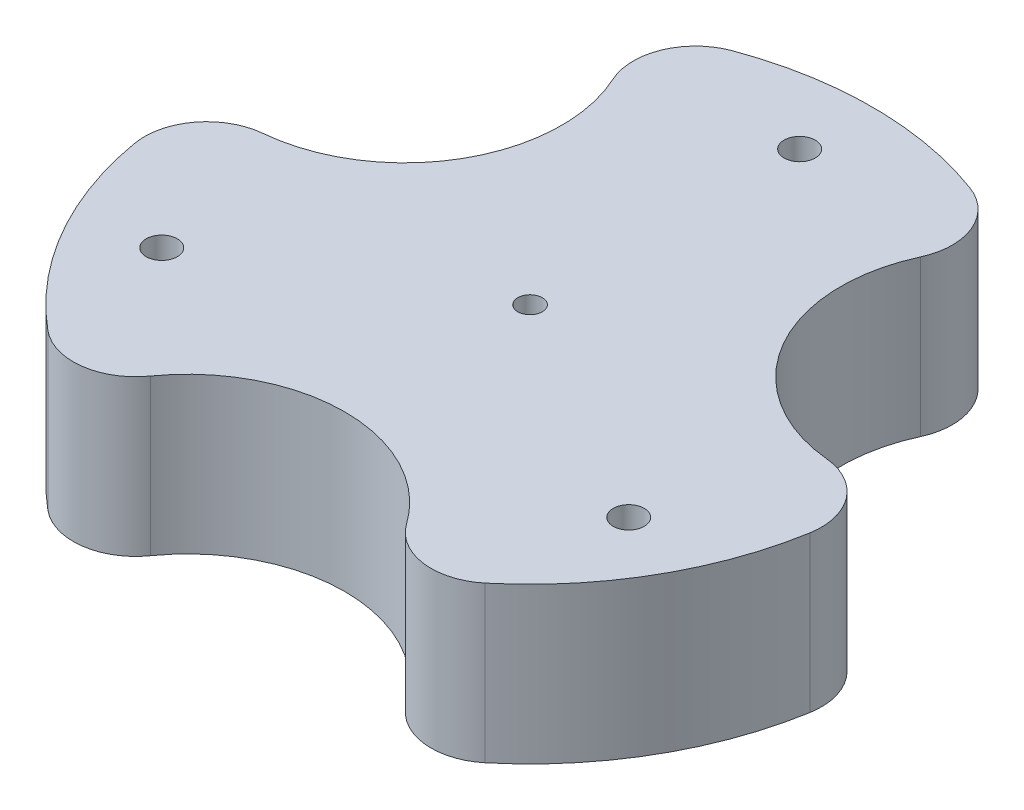
ISO-10303-21;
HEADER;
FILE_DESCRIPTION(('STEP AP214'),'2;1');
FILE_NAME('part.step','',(''),(''),'','','');
FILE_SCHEMA(('AUTOMOTIVE_DESIGN { 1 0 10303 214 1 1 1 1 }'));
ENDSEC;
DATA;
#1=APPLICATION_CONTEXT('core data for automotive mechanical design processes');
#2=APPLICATION_PROTOCOL_DEFINITION('international standard','automotive_design',2000,#1);
#3=PRODUCT_CONTEXT('',#1,'mechanical');
#4=PRODUCT('Part','Part','',(#3));
#5=PRODUCT_RELATED_PRODUCT_CATEGORY('part','',(#4));
#6=PRODUCT_DEFINITION_FORMATION('','',#4);
#7=PRODUCT_DEFINITION_CONTEXT('part definition',#1,'design');
#8=PRODUCT_DEFINITION('design','',#6,#7);
#9=PRODUCT_DEFINITION_SHAPE('','',#8);
#10=(LENGTH_UNIT() NAMED_UNIT(*) SI_UNIT(.MILLI.,.METRE.));
#11=(NAMED_UNIT(*) PLANE_ANGLE_UNIT() SI_UNIT($,.RADIAN.));
#12=(NAMED_UNIT(*) SI_UNIT($,.STERADIAN.) SOLID_ANGLE_UNIT());
#13=UNCERTAINTY_MEASURE_WITH_UNIT(LENGTH_MEASURE(1.E-05),#10,'distance_accuracy_value','');
#14=(GEOMETRIC_REPRESENTATION_CONTEXT(3) GLOBAL_UNCERTAINTY_ASSIGNED_CONTEXT((#13)) GLOBAL_UNIT_ASSIGNED_CONTEXT((#10,
#11,#12)) REPRESENTATION_CONTEXT('',''));
#15=CARTESIAN_POINT('',(0.,0.,0.));
#16=DIRECTION('',(0.,0.,1.));
#17=DIRECTION('',(1.,0.,0.));
#18=AXIS2_PLACEMENT_3D('',#15,#16,#17);
#19=CARTESIAN_POINT('',(0.,6.35,0.));
#20=DIRECTION('',(0.,-1.,0.));
#21=DIRECTION('',(0.,0.,-1.));
#22=AXIS2_PLACEMENT_3D('',#19,#20,#21);
#23=CYLINDRICAL_SURFACE('',#22,13.97);
#24=CARTESIAN_POINT('',(0.,0.,0.));
#25=DIRECTION('',(0.,1.,0.));
#26=DIRECTION('',(0.,0.,1.));
#27=AXIS2_PLACEMENT_3D('',#24,#25,#26);
#28=CIRCLE('',#27,13.97);
#29=CARTESIAN_POINT('',(8.92101024492811,0.,10.7506500366205));
#30=VERTEX_POINT('',#29);
#31=CARTESIAN_POINT('',(13.7708411613735,0.,2.35049648121887));
#32=VERTEX_POINT('',#31);
#33=EDGE_CURVE('E140',#30,#32,#28,.T.);
#34=ORIENTED_EDGE('',*,*,#33,.T.);
#35=DIRECTION('',(0.,-1.,0.));
#36=VECTOR('',#35,1.);
#37=CARTESIAN_POINT('',(13.7708411613735,6.35,2.35049648121887));
#38=LINE('',#37,#36);
#39=CARTESIAN_POINT('',(13.7708411613735,6.35,2.35049648121887));
#40=VERTEX_POINT('',#39);
#41=EDGE_CURVE('E144',#32,#40,#38,.F.);
#42=ORIENTED_EDGE('',*,*,#41,.T.);
#43=CARTESIAN_POINT('',(0.,6.35,0.));
#44=DIRECTION('',(0.,1.,0.));
#45=DIRECTION('',(0.,0.,1.));
#46=AXIS2_PLACEMENT_3D('',#43,#44,#45);
#47=CIRCLE('',#46,13.97);
#48=CARTESIAN_POINT('',(8.92101024492811,6.35,10.7506500366205));
#49=VERTEX_POINT('',#48);
#50=EDGE_CURVE('E143',#49,#40,#47,.T.);
#51=ORIENTED_EDGE('',*,*,#50,.F.);
#52=DIRECTION('',(0.,-1.,0.));
#53=VECTOR('',#52,1.);
#54=CARTESIAN_POINT('',(8.92101024492811,6.35,10.7506500366205));
#55=LINE('',#54,#53);
#56=EDGE_CURVE('E128',#49,#30,#55,.T.);
#57=ORIENTED_EDGE('',*,*,#56,.T.);
#58=EDGE_LOOP('',(#34,#42,#51,#57));
#59=FACE_BOUND('',#58,.T.);
#60=ADVANCED_FACE('F34',(#59),#23,.T.);
#61=CARTESIAN_POINT('',(4.8498309164455,0.,-13.1011465178392));
#62=VERTEX_POINT('',#61);
#63=CARTESIAN_POINT('',(-4.84983091644532,0.,-13.1011465178392));
#64=VERTEX_POINT('',#63);
#65=EDGE_CURVE('E150',#62,#64,#28,.T.);
#66=ORIENTED_EDGE('',*,*,#65,.T.);
#67=DIRECTION('',(0.,-1.,0.));
#68=VECTOR('',#67,1.);
#69=CARTESIAN_POINT('',(-4.84983091644532,6.35,-13.1011465178392));
#70=LINE('',#69,#68);
#71=CARTESIAN_POINT('',(-4.84983091644532,6.35,-13.1011465178392));
#72=VERTEX_POINT('',#71);
#73=EDGE_CURVE('E11',#64,#72,#70,.F.);
#74=ORIENTED_EDGE('',*,*,#73,.T.);
#75=CARTESIAN_POINT('',(4.8498309164455,6.35,-13.1011465178392));
#76=VERTEX_POINT('',#75);
#77=EDGE_CURVE('E154',#76,#72,#47,.T.);
#78=ORIENTED_EDGE('',*,*,#77,.F.);
#79=DIRECTION('',(0.,-1.,0.));
#80=VECTOR('',#79,1.);
#81=CARTESIAN_POINT('',(4.8498309164455,6.35,-13.1011465178392));
#82=LINE('',#81,#80);
#83=EDGE_CURVE('E42',#76,#62,#82,.T.);
#84=ORIENTED_EDGE('',*,*,#83,.T.);
#85=EDGE_LOOP('',(#66,#74,#78,#84));
#86=FACE_BOUND('',#85,.T.);
#87=ADVANCED_FACE('F234',(#86),#23,.T.);
#88=CARTESIAN_POINT('',(-13.7708411613735,0.,2.35049648121868));
#89=VERTEX_POINT('',#88);
#90=CARTESIAN_POINT('',(-8.92101024492811,0.,10.7506500366205));
#91=VERTEX_POINT('',#90);
#92=EDGE_CURVE('E152',#89,#91,#28,.T.);
#93=ORIENTED_EDGE('',*,*,#92,.T.);
#94=DIRECTION('',(0.,-1.,0.));
#95=VECTOR('',#94,1.);
#96=CARTESIAN_POINT('',(-8.92101024492811,6.35,10.7506500366205));
#97=LINE('',#96,#95);
#98=CARTESIAN_POINT('',(-8.92101024492811,6.35,10.7506500366205));
#99=VERTEX_POINT('',#98);
#100=EDGE_CURVE('E386',#91,#99,#97,.F.);
#101=ORIENTED_EDGE('',*,*,#100,.T.);
#102=CARTESIAN_POINT('',(-13.7708411613735,6.35,2.35049648121868));
#103=VERTEX_POINT('',#102);
#104=EDGE_CURVE('E149',#103,#99,#47,.T.);
#105=ORIENTED_EDGE('',*,*,#104,.F.);
#106=DIRECTION('',(0.,-1.,0.));
#107=VECTOR('',#106,1.);
#108=CARTESIAN_POINT('',(-13.7708411613735,6.35,2.35049648121868));
#109=LINE('',#108,#107);
#110=EDGE_CURVE('E395',#103,#89,#109,.T.);
#111=ORIENTED_EDGE('',*,*,#110,.T.);
#112=EDGE_LOOP('',(#93,#101,#105,#111));
#113=FACE_BOUND('',#112,.T.);
#114=ADVANCED_FACE('F210',(#113),#23,.T.);
#115=CARTESIAN_POINT('',(0.,6.35,0.));
#116=DIRECTION('',(0.,1.,0.));
#117=DIRECTION('',(0.,0.,1.));
#118=AXIS2_PLACEMENT_3D('',#115,#116,#117);
#119=PLANE('',#118);
#120=CARTESIAN_POINT('',(0.,6.35,0.));
#121=DIRECTION('',(0.,1.,0.));
#122=DIRECTION('',(0.,0.,1.));
#123=AXIS2_PLACEMENT_3D('',#120,#121,#122);
#124=CIRCLE('',#123,0.499999999999997);
#125=CARTESIAN_POINT('',(0.,6.35,0.499999999999997));
#126=VERTEX_POINT('',#125);
#127=EDGE_CURVE('E200',#126,#126,#124,.T.);
#128=ORIENTED_EDGE('',*,*,#127,.F.);
#129=EDGE_LOOP('',(#128));
#130=FACE_BOUND('',#129,.T.);
#131=ORIENTED_EDGE('',*,*,#50,.T.);
#132=CARTESIAN_POINT('',(11.2670518593056,6.35,1.92313348463362));
#133=DIRECTION('',(0.,1.,0.));
#134=DIRECTION('',(0.,0.,1.));
#135=AXIS2_PLACEMENT_3D('',#132,#133,#134);
#136=CIRCLE('',#135,2.54);
#137=CARTESIAN_POINT('',(11.5030637447277,6.35,-0.605877861710929));
#138=VERTEX_POINT('',#137);
#139=EDGE_CURVE('E416',#40,#138,#136,.T.);
#140=ORIENTED_EDGE('',*,*,#139,.T.);
#141=CARTESIAN_POINT('',(12.0983748908687,6.35,-6.98499999999989));
#142=DIRECTION('',(0.,1.,0.));
#143=DIRECTION('',(0.866025403784443,0.,-0.499999999999992));
#144=AXIS2_PLACEMENT_3D('',#141,#142,#143);
#145=CIRCLE('',#144,6.40683967459214);
#146=CARTESIAN_POINT('',(6.2762374921963,6.35,-9.65900649343038));
#147=VERTEX_POINT('',#146);
#148=EDGE_CURVE('E193',#147,#138,#145,.T.);
#149=ORIENTED_EDGE('',*,*,#148,.F.);
#150=CARTESIAN_POINT('',(3.96804347709178,6.35,-10.719119878232));
#151=DIRECTION('',(0.,1.,0.));
#152=DIRECTION('',(0.,0.,1.));
#153=AXIS2_PLACEMENT_3D('',#150,#151,#152);
#154=CIRCLE('',#153,2.54);
#155=EDGE_CURVE('E426',#147,#76,#154,.T.);
#156=ORIENTED_EDGE('',*,*,#155,.T.);
#157=ORIENTED_EDGE('',*,*,#77,.T.);
#158=CARTESIAN_POINT('',(-3.96804347709163,6.35,-10.7191198782321));
#159=DIRECTION('',(0.,1.,0.));
#160=DIRECTION('',(0.,0.,1.));
#161=AXIS2_PLACEMENT_3D('',#158,#159,#160);
#162=CIRCLE('',#161,2.54);
#163=CARTESIAN_POINT('',(-6.27623749219617,6.35,-9.65900649343047));
#164=VERTEX_POINT('',#163);
#165=EDGE_CURVE('E424',#72,#164,#162,.T.);
#166=ORIENTED_EDGE('',*,*,#165,.T.);
#167=CARTESIAN_POINT('',(-12.0983748908686,6.35,-6.98500000000006));
#168=DIRECTION('',(0.,1.,0.));
#169=DIRECTION('',(-0.866025403784436,0.,-0.500000000000004));
#170=AXIS2_PLACEMENT_3D('',#167,#168,#169);
#171=CIRCLE('',#170,6.40683967459214);
#172=CARTESIAN_POINT('',(-11.5030637447277,6.35,-0.605877861711092));
#173=VERTEX_POINT('',#172);
#174=EDGE_CURVE('E189',#173,#164,#171,.T.);
#175=ORIENTED_EDGE('',*,*,#174,.F.);
#176=CARTESIAN_POINT('',(-11.2670518593056,6.35,1.92313348463346));
#177=DIRECTION('',(0.,1.,0.));
#178=DIRECTION('',(0.,0.,1.));
#179=AXIS2_PLACEMENT_3D('',#176,#177,#178);
#180=CIRCLE('',#179,2.54);
#181=EDGE_CURVE('E422',#173,#103,#180,.T.);
#182=ORIENTED_EDGE('',*,*,#181,.T.);
#183=ORIENTED_EDGE('',*,*,#104,.T.);
#184=CARTESIAN_POINT('',(-7.29900838221391,6.35,8.79598639359857));
#185=DIRECTION('',(0.,1.,0.));
#186=DIRECTION('',(0.,0.,1.));
#187=AXIS2_PLACEMENT_3D('',#184,#185,#186);
#188=CIRCLE('',#187,2.54);
#189=CARTESIAN_POINT('',(-5.22682625253151,6.35,10.2648843551415));
#190=VERTEX_POINT('',#189);
#191=EDGE_CURVE('E420',#99,#190,#188,.T.);
#192=ORIENTED_EDGE('',*,*,#191,.T.);
#193=CARTESIAN_POINT('',(0.,6.35,13.97));
#194=DIRECTION('',(0.,1.,0.));
#195=DIRECTION('',(0.,0.,1.));
#196=AXIS2_PLACEMENT_3D('',#193,#194,#195);
#197=CIRCLE('',#196,6.40683967459214);
#198=CARTESIAN_POINT('',(5.22682625253151,6.35,10.2648843551415));
#199=VERTEX_POINT('',#198);
#200=EDGE_CURVE('E184',#199,#190,#197,.T.);
#201=ORIENTED_EDGE('',*,*,#200,.F.);
#202=CARTESIAN_POINT('',(7.29900838221391,6.35,8.79598639359857));
#203=DIRECTION('',(0.,1.,0.));
#204=DIRECTION('',(0.,0.,1.));
#205=AXIS2_PLACEMENT_3D('',#202,#203,#204);
#206=CIRCLE('',#205,2.54);
#207=EDGE_CURVE('E418',#199,#49,#206,.T.);
#208=ORIENTED_EDGE('',*,*,#207,.T.);
#209=EDGE_LOOP('',(#131,#140,#149,#156,#157,#166,#175,#182,#183,#192,#201,#208));
#210=FACE_BOUND('',#209,.T.);
#211=CARTESIAN_POINT('',(-9.52627944162887,6.35,5.49999999999991));
#212=DIRECTION('',(0.,1.,0.));
#213=DIRECTION('',(0.866025403784443,0.,-0.499999999999992));
#214=AXIS2_PLACEMENT_3D('',#211,#212,#213);
#215=CIRCLE('',#214,0.635);
#216=CARTESIAN_POINT('',(-8.97635331022575,6.35,5.18249999999992));
#217=VERTEX_POINT('',#216);
#218=EDGE_CURVE('E178',#217,#217,#215,.T.);
#219=ORIENTED_EDGE('',*,*,#218,.F.);
#220=EDGE_LOOP('',(#219));
#221=FACE_BOUND('',#220,.T.);
#222=CARTESIAN_POINT('',(9.5262794416288,6.35,5.50000000000004));
#223=DIRECTION('',(0.,1.,0.));
#224=DIRECTION('',(-0.866025403784436,0.,-0.500000000000004));
#225=AXIS2_PLACEMENT_3D('',#222,#223,#224);
#226=CIRCLE('',#225,0.635);
#227=CARTESIAN_POINT('',(8.97635331022568,6.35,5.18250000000004));
#228=VERTEX_POINT('',#227);
#229=EDGE_CURVE('E172',#228,#228,#226,.T.);
#230=ORIENTED_EDGE('',*,*,#229,.F.);
#231=EDGE_LOOP('',(#230));
#232=FACE_BOUND('',#231,.T.);
#233=CARTESIAN_POINT('',(0.,6.35,-11.));
#234=DIRECTION('',(0.,1.,0.));
#235=DIRECTION('',(0.,0.,1.));
#236=AXIS2_PLACEMENT_3D('',#233,#234,#235);
#237=CIRCLE('',#236,0.635);
#238=CARTESIAN_POINT('',(0.,6.35,-10.365));
#239=VERTEX_POINT('',#238);
#240=EDGE_CURVE('E164',#239,#239,#237,.T.);
#241=ORIENTED_EDGE('',*,*,#240,.F.);
#242=EDGE_LOOP('',(#241));
#243=FACE_BOUND('',#242,.T.);
#244=ADVANCED_FACE('F207',(#130,#210,#221,#232,#243),#119,.T.);
#245=CARTESIAN_POINT('',(0.,0.,0.));
#246=DIRECTION('',(0.,1.,0.));
#247=DIRECTION('',(0.,0.,1.));
#248=AXIS2_PLACEMENT_3D('',#245,#246,#247);
#249=PLANE('',#248);
#250=CARTESIAN_POINT('',(0.,0.,0.));
#251=DIRECTION('',(0.,1.,0.));
#252=DIRECTION('',(0.,0.,1.));
#253=AXIS2_PLACEMENT_3D('',#250,#251,#252);
#254=CIRCLE('',#253,0.499999999999995);
#255=CARTESIAN_POINT('',(0.,0.,0.499999999999995));
#256=VERTEX_POINT('',#255);
#257=EDGE_CURVE('E196',#256,#256,#254,.T.);
#258=ORIENTED_EDGE('',*,*,#257,.T.);
#259=EDGE_LOOP('',(#258));
#260=FACE_BOUND('',#259,.T.);
#261=CARTESIAN_POINT('',(-9.52627944162887,0.,5.49999999999991));
#262=DIRECTION('',(0.,1.,0.));
#263=DIRECTION('',(0.866025403784443,0.,-0.499999999999992));
#264=AXIS2_PLACEMENT_3D('',#261,#262,#263);
#265=CIRCLE('',#264,0.635);
#266=CARTESIAN_POINT('',(-8.97635331022575,0.,5.18249999999992));
#267=VERTEX_POINT('',#266);
#268=EDGE_CURVE('E175',#267,#267,#265,.T.);
#269=ORIENTED_EDGE('',*,*,#268,.T.);
#270=EDGE_LOOP('',(#269));
#271=FACE_BOUND('',#270,.T.);
#272=CARTESIAN_POINT('',(9.5262794416288,0.,5.50000000000004));
#273=DIRECTION('',(0.,1.,0.));
#274=DIRECTION('',(-0.866025403784436,0.,-0.500000000000004));
#275=AXIS2_PLACEMENT_3D('',#272,#273,#274);
#276=CIRCLE('',#275,0.635);
#277=CARTESIAN_POINT('',(8.97635331022568,0.,5.18250000000004));
#278=VERTEX_POINT('',#277);
#279=EDGE_CURVE('E169',#278,#278,#276,.T.);
#280=ORIENTED_EDGE('',*,*,#279,.T.);
#281=EDGE_LOOP('',(#280));
#282=FACE_BOUND('',#281,.T.);
#283=CARTESIAN_POINT('',(0.,0.,-11.));
#284=DIRECTION('',(0.,1.,0.));
#285=DIRECTION('',(0.,0.,1.));
#286=AXIS2_PLACEMENT_3D('',#283,#284,#285);
#287=CIRCLE('',#286,0.635);
#288=CARTESIAN_POINT('',(0.,0.,-10.365));
#289=VERTEX_POINT('',#288);
#290=EDGE_CURVE('E158',#289,#289,#287,.T.);
#291=ORIENTED_EDGE('',*,*,#290,.T.);
#292=EDGE_LOOP('',(#291));
#293=FACE_BOUND('',#292,.T.);
#294=CARTESIAN_POINT('',(12.0983748908687,0.,-6.98499999999989));
#295=DIRECTION('',(0.,1.,0.));
#296=DIRECTION('',(0.866025403784443,0.,-0.499999999999992));
#297=AXIS2_PLACEMENT_3D('',#294,#295,#296);
#298=CIRCLE('',#297,6.40683967459214);
#299=CARTESIAN_POINT('',(6.2762374921963,0.,-9.65900649343038));
#300=VERTEX_POINT('',#299);
#301=CARTESIAN_POINT('',(11.5030637447277,0.,-0.605877861710929));
#302=VERTEX_POINT('',#301);
#303=EDGE_CURVE('E191',#300,#302,#298,.T.);
#304=ORIENTED_EDGE('',*,*,#303,.T.);
#305=CARTESIAN_POINT('',(11.2670518593056,0.,1.92313348463362));
#306=DIRECTION('',(0.,1.,0.));
#307=DIRECTION('',(0.,0.,1.));
#308=AXIS2_PLACEMENT_3D('',#305,#306,#307);
#309=CIRCLE('',#308,2.54);
#310=EDGE_CURVE('E133',#302,#32,#309,.F.);
#311=ORIENTED_EDGE('',*,*,#310,.T.);
#312=ORIENTED_EDGE('',*,*,#33,.F.);
#313=CARTESIAN_POINT('',(7.29900838221391,0.,8.79598639359857));
#314=DIRECTION('',(0.,1.,0.));
#315=DIRECTION('',(0.,0.,1.));
#316=AXIS2_PLACEMENT_3D('',#313,#314,#315);
#317=CIRCLE('',#316,2.54);
#318=CARTESIAN_POINT('',(5.22682625253151,0.,10.2648843551415));
#319=VERTEX_POINT('',#318);
#320=EDGE_CURVE('E124',#30,#319,#317,.F.);
#321=ORIENTED_EDGE('',*,*,#320,.T.);
#322=CARTESIAN_POINT('',(0.,0.,13.97));
#323=DIRECTION('',(0.,1.,0.));
#324=DIRECTION('',(0.,0.,1.));
#325=AXIS2_PLACEMENT_3D('',#322,#323,#324);
#326=CIRCLE('',#325,6.40683967459214);
#327=CARTESIAN_POINT('',(-5.22682625253151,0.,10.2648843551415));
#328=VERTEX_POINT('',#327);
#329=EDGE_CURVE('E181',#319,#328,#326,.T.);
#330=ORIENTED_EDGE('',*,*,#329,.T.);
#331=CARTESIAN_POINT('',(-7.29900838221391,0.,8.79598639359857));
#332=DIRECTION('',(0.,1.,0.));
#333=DIRECTION('',(0.,0.,1.));
#334=AXIS2_PLACEMENT_3D('',#331,#332,#333);
#335=CIRCLE('',#334,2.54);
#336=EDGE_CURVE('E134',#328,#91,#335,.F.);
#337=ORIENTED_EDGE('',*,*,#336,.T.);
#338=ORIENTED_EDGE('',*,*,#92,.F.);
#339=CARTESIAN_POINT('',(-11.2670518593056,0.,1.92313348463346));
#340=DIRECTION('',(0.,1.,0.));
#341=DIRECTION('',(0.,0.,1.));
#342=AXIS2_PLACEMENT_3D('',#339,#340,#341);
#343=CIRCLE('',#342,2.54);
#344=CARTESIAN_POINT('',(-11.5030637447277,0.,-0.605877861711092));
#345=VERTEX_POINT('',#344);
#346=EDGE_CURVE('E56',#89,#345,#343,.F.);
#347=ORIENTED_EDGE('',*,*,#346,.T.);
#348=CARTESIAN_POINT('',(-12.0983748908686,0.,-6.98500000000006));
#349=DIRECTION('',(0.,1.,0.));
#350=DIRECTION('',(-0.866025403784436,0.,-0.500000000000004));
#351=AXIS2_PLACEMENT_3D('',#348,#349,#350);
#352=CIRCLE('',#351,6.40683967459214);
#353=CARTESIAN_POINT('',(-6.27623749219617,0.,-9.65900649343047));
#354=VERTEX_POINT('',#353);
#355=EDGE_CURVE('E187',#345,#354,#352,.T.);
#356=ORIENTED_EDGE('',*,*,#355,.T.);
#357=CARTESIAN_POINT('',(-3.96804347709163,0.,-10.7191198782321));
#358=DIRECTION('',(0.,1.,0.));
#359=DIRECTION('',(0.,0.,1.));
#360=AXIS2_PLACEMENT_3D('',#357,#358,#359);
#361=CIRCLE('',#360,2.54);
#362=EDGE_CURVE('E388',#354,#64,#361,.F.);
#363=ORIENTED_EDGE('',*,*,#362,.T.);
#364=ORIENTED_EDGE('',*,*,#65,.F.);
#365=CARTESIAN_POINT('',(3.96804347709178,0.,-10.719119878232));
#366=DIRECTION('',(0.,1.,0.));
#367=DIRECTION('',(0.,0.,1.));
#368=AXIS2_PLACEMENT_3D('',#365,#366,#367);
#369=CIRCLE('',#368,2.54);
#370=EDGE_CURVE('E407',#62,#300,#369,.F.);
#371=ORIENTED_EDGE('',*,*,#370,.T.);
#372=EDGE_LOOP('',(#304,#311,#312,#321,#330,#337,#338,#347,#356,#363,#364,#371));
#373=FACE_BOUND('',#372,.T.);
#374=ADVANCED_FACE('F147',(#260,#271,#282,#293,#373),#249,.F.);
#375=CARTESIAN_POINT('',(0.,0.,-11.));
#376=DIRECTION('',(0.,1.,0.));
#377=DIRECTION('',(0.,0.,1.));
#378=AXIS2_PLACEMENT_3D('',#375,#376,#377);
#379=CYLINDRICAL_SURFACE('',#378,0.635);
#380=ORIENTED_EDGE('',*,*,#290,.F.);
#381=EDGE_LOOP('',(#380));
#382=FACE_BOUND('',#381,.T.);
#383=ORIENTED_EDGE('',*,*,#240,.T.);
#384=EDGE_LOOP('',(#383));
#385=FACE_BOUND('',#384,.T.);
#386=ADVANCED_FACE('F219',(#382,#385),#379,.F.);
#387=CARTESIAN_POINT('',(9.5262794416288,0.,5.50000000000004));
#388=DIRECTION('',(0.,1.,0.));
#389=DIRECTION('',(0.,0.,1.));
#390=AXIS2_PLACEMENT_3D('',#387,#388,#389);
#391=CYLINDRICAL_SURFACE('',#390,0.635);
#392=ORIENTED_EDGE('',*,*,#279,.F.);
#393=EDGE_LOOP('',(#392));
#394=FACE_BOUND('',#393,.T.);
#395=ORIENTED_EDGE('',*,*,#229,.T.);
#396=EDGE_LOOP('',(#395));
#397=FACE_BOUND('',#396,.T.);
#398=ADVANCED_FACE('F221',(#394,#397),#391,.F.);
#399=CARTESIAN_POINT('',(-9.52627944162887,0.,5.49999999999991));
#400=DIRECTION('',(0.,1.,0.));
#401=DIRECTION('',(0.,0.,1.));
#402=AXIS2_PLACEMENT_3D('',#399,#400,#401);
#403=CYLINDRICAL_SURFACE('',#402,0.635);
#404=ORIENTED_EDGE('',*,*,#268,.F.);
#405=EDGE_LOOP('',(#404));
#406=FACE_BOUND('',#405,.T.);
#407=ORIENTED_EDGE('',*,*,#218,.T.);
#408=EDGE_LOOP('',(#407));
#409=FACE_BOUND('',#408,.T.);
#410=ADVANCED_FACE('F228',(#406,#409),#403,.F.);
#411=CARTESIAN_POINT('',(0.,0.,13.97));
#412=DIRECTION('',(0.,1.,0.));
#413=DIRECTION('',(0.,0.,1.));
#414=AXIS2_PLACEMENT_3D('',#411,#412,#413);
#415=CYLINDRICAL_SURFACE('',#414,6.40683967459214);
#416=ORIENTED_EDGE('',*,*,#329,.F.);
#417=DIRECTION('',(0.,1.,0.));
#418=VECTOR('',#417,1.);
#419=CARTESIAN_POINT('',(5.22682625253151,0.,10.2648843551415));
#420=LINE('',#419,#418);
#421=EDGE_CURVE('E129',#319,#199,#420,.T.);
#422=ORIENTED_EDGE('',*,*,#421,.T.);
#423=ORIENTED_EDGE('',*,*,#200,.T.);
#424=DIRECTION('',(0.,1.,0.));
#425=VECTOR('',#424,1.);
#426=CARTESIAN_POINT('',(-5.22682625253151,0.,10.2648843551415));
#427=LINE('',#426,#425);
#428=EDGE_CURVE('E384',#190,#328,#427,.F.);
#429=ORIENTED_EDGE('',*,*,#428,.T.);
#430=EDGE_LOOP('',(#416,#422,#423,#429));
#431=FACE_BOUND('',#430,.T.);
#432=ADVANCED_FACE('F323',(#431),#415,.F.);
#433=CARTESIAN_POINT('',(-12.0983748908686,0.,-6.98500000000006));
#434=DIRECTION('',(0.,1.,0.));
#435=DIRECTION('',(0.,0.,1.));
#436=AXIS2_PLACEMENT_3D('',#433,#434,#435);
#437=CYLINDRICAL_SURFACE('',#436,6.40683967459214);
#438=ORIENTED_EDGE('',*,*,#355,.F.);
#439=DIRECTION('',(0.,1.,0.));
#440=VECTOR('',#439,1.);
#441=CARTESIAN_POINT('',(-11.5030637447277,0.,-0.60587786171109));
#442=LINE('',#441,#440);
#443=EDGE_CURVE('E399',#345,#173,#442,.T.);
#444=ORIENTED_EDGE('',*,*,#443,.T.);
#445=ORIENTED_EDGE('',*,*,#174,.T.);
#446=DIRECTION('',(0.,1.,0.));
#447=VECTOR('',#446,1.);
#448=CARTESIAN_POINT('',(-6.27623749219617,0.,-9.65900649343047));
#449=LINE('',#448,#447);
#450=EDGE_CURVE('E49',#164,#354,#449,.F.);
#451=ORIENTED_EDGE('',*,*,#450,.T.);
#452=EDGE_LOOP('',(#438,#444,#445,#451));
#453=FACE_BOUND('',#452,.T.);
#454=ADVANCED_FACE('F315',(#453),#437,.F.);
#455=CARTESIAN_POINT('',(12.0983748908687,0.,-6.98499999999989));
#456=DIRECTION('',(0.,1.,0.));
#457=DIRECTION('',(0.,0.,1.));
#458=AXIS2_PLACEMENT_3D('',#455,#456,#457);
#459=CYLINDRICAL_SURFACE('',#458,6.40683967459214);
#460=ORIENTED_EDGE('',*,*,#148,.T.);
#461=DIRECTION('',(0.,1.,0.));
#462=VECTOR('',#461,1.);
#463=CARTESIAN_POINT('',(11.5030637447277,0.,-0.605877861710929));
#464=LINE('',#463,#462);
#465=EDGE_CURVE('E410',#138,#302,#464,.F.);
#466=ORIENTED_EDGE('',*,*,#465,.T.);
#467=ORIENTED_EDGE('',*,*,#303,.F.);
#468=DIRECTION('',(0.,1.,0.));
#469=VECTOR('',#468,1.);
#470=CARTESIAN_POINT('',(6.2762374921963,0.,-9.65900649343038));
#471=LINE('',#470,#469);
#472=EDGE_CURVE('E414',#300,#147,#471,.T.);
#473=ORIENTED_EDGE('',*,*,#472,.T.);
#474=EDGE_LOOP('',(#460,#466,#467,#473));
#475=FACE_BOUND('',#474,.T.);
#476=ADVANCED_FACE('F308',(#475),#459,.F.);
#477=CARTESIAN_POINT('',(11.2670518593056,0.,1.92313348463362));
#478=DIRECTION('',(0.,-1.,0.));
#479=DIRECTION('',(0.,0.,-1.));
#480=AXIS2_PLACEMENT_3D('',#477,#478,#479);
#481=CYLINDRICAL_SURFACE('',#480,2.54);
#482=ORIENTED_EDGE('',*,*,#310,.F.);
#483=ORIENTED_EDGE('',*,*,#465,.F.);
#484=ORIENTED_EDGE('',*,*,#139,.F.);
#485=ORIENTED_EDGE('',*,*,#41,.F.);
#486=EDGE_LOOP('',(#482,#483,#484,#485));
#487=FACE_BOUND('',#486,.T.);
#488=ADVANCED_FACE('F301',(#487),#481,.T.);
#489=CARTESIAN_POINT('',(7.29900838221391,0.,8.79598639359857));
#490=DIRECTION('',(0.,1.,0.));
#491=DIRECTION('',(0.,0.,1.));
#492=AXIS2_PLACEMENT_3D('',#489,#490,#491);
#493=CYLINDRICAL_SURFACE('',#492,2.54);
#494=ORIENTED_EDGE('',*,*,#207,.F.);
#495=ORIENTED_EDGE('',*,*,#421,.F.);
#496=ORIENTED_EDGE('',*,*,#320,.F.);
#497=ORIENTED_EDGE('',*,*,#56,.F.);
#498=EDGE_LOOP('',(#494,#495,#496,#497));
#499=FACE_BOUND('',#498,.T.);
#500=ADVANCED_FACE('F127',(#499),#493,.T.);
#501=CARTESIAN_POINT('',(-7.29900838221391,0.,8.79598639359857));
#502=DIRECTION('',(0.,-1.,0.));
#503=DIRECTION('',(0.,0.,-1.));
#504=AXIS2_PLACEMENT_3D('',#501,#502,#503);
#505=CYLINDRICAL_SURFACE('',#504,2.54);
#506=ORIENTED_EDGE('',*,*,#336,.F.);
#507=ORIENTED_EDGE('',*,*,#428,.F.);
#508=ORIENTED_EDGE('',*,*,#191,.F.);
#509=ORIENTED_EDGE('',*,*,#100,.F.);
#510=EDGE_LOOP('',(#506,#507,#508,#509));
#511=FACE_BOUND('',#510,.T.);
#512=ADVANCED_FACE('F286',(#511),#505,.T.);
#513=CARTESIAN_POINT('',(-11.2670518593056,0.,1.92313348463346));
#514=DIRECTION('',(0.,1.,0.));
#515=DIRECTION('',(0.,0.,1.));
#516=AXIS2_PLACEMENT_3D('',#513,#514,#515);
#517=CYLINDRICAL_SURFACE('',#516,2.54);
#518=ORIENTED_EDGE('',*,*,#181,.F.);
#519=ORIENTED_EDGE('',*,*,#443,.F.);
#520=ORIENTED_EDGE('',*,*,#346,.F.);
#521=ORIENTED_EDGE('',*,*,#110,.F.);
#522=EDGE_LOOP('',(#518,#519,#520,#521));
#523=FACE_BOUND('',#522,.T.);
#524=ADVANCED_FACE('F279',(#523),#517,.T.);
#525=CARTESIAN_POINT('',(-3.96804347709163,0.,-10.7191198782321));
#526=DIRECTION('',(0.,-1.,0.));
#527=DIRECTION('',(0.,0.,-1.));
#528=AXIS2_PLACEMENT_3D('',#525,#526,#527);
#529=CYLINDRICAL_SURFACE('',#528,2.54);
#530=ORIENTED_EDGE('',*,*,#362,.F.);
#531=ORIENTED_EDGE('',*,*,#450,.F.);
#532=ORIENTED_EDGE('',*,*,#165,.F.);
#533=ORIENTED_EDGE('',*,*,#73,.F.);
#534=EDGE_LOOP('',(#530,#531,#532,#533));
#535=FACE_BOUND('',#534,.T.);
#536=ADVANCED_FACE('F273',(#535),#529,.T.);
#537=CARTESIAN_POINT('',(3.96804347709178,0.,-10.719119878232));
#538=DIRECTION('',(0.,1.,0.));
#539=DIRECTION('',(0.,0.,1.));
#540=AXIS2_PLACEMENT_3D('',#537,#538,#539);
#541=CYLINDRICAL_SURFACE('',#540,2.54);
#542=ORIENTED_EDGE('',*,*,#155,.F.);
#543=ORIENTED_EDGE('',*,*,#472,.F.);
#544=ORIENTED_EDGE('',*,*,#370,.F.);
#545=ORIENTED_EDGE('',*,*,#83,.F.);
#546=EDGE_LOOP('',(#542,#543,#544,#545));
#547=FACE_BOUND('',#546,.T.);
#548=ADVANCED_FACE('F36',(#547),#541,.T.);
#549=CARTESIAN_POINT('',(0.,6.35,0.));
#550=DIRECTION('',(0.,1.,0.));
#551=DIRECTION('',(0.,0.,1.));
#552=AXIS2_PLACEMENT_3D('',#549,#550,#551);
#553=CYLINDRICAL_SURFACE('',#552,0.499999999999995);
#554=ORIENTED_EDGE('',*,*,#127,.T.);
#555=EDGE_LOOP('',(#554));
#556=FACE_BOUND('',#555,.T.);
#557=ORIENTED_EDGE('',*,*,#257,.F.);
#558=EDGE_LOOP('',(#557));
#559=FACE_BOUND('',#558,.T.);
#560=ADVANCED_FACE('F204',(#556,#559),#553,.F.);
#561=CLOSED_SHELL('',(#60,#87,#114,#244,#374,#386,#398,#410,#432,#454,#476,#488,#500,#512,#524,
#536,#548,#560));
#562=MANIFOLD_SOLID_BREP('B2',#561);
#563=ADVANCED_BREP_SHAPE_REPRESENTATION('',(#18,#562),#14);
#564=SHAPE_DEFINITION_REPRESENTATION(#9,#563);
ENDSEC;
END-ISO-10303-21;
